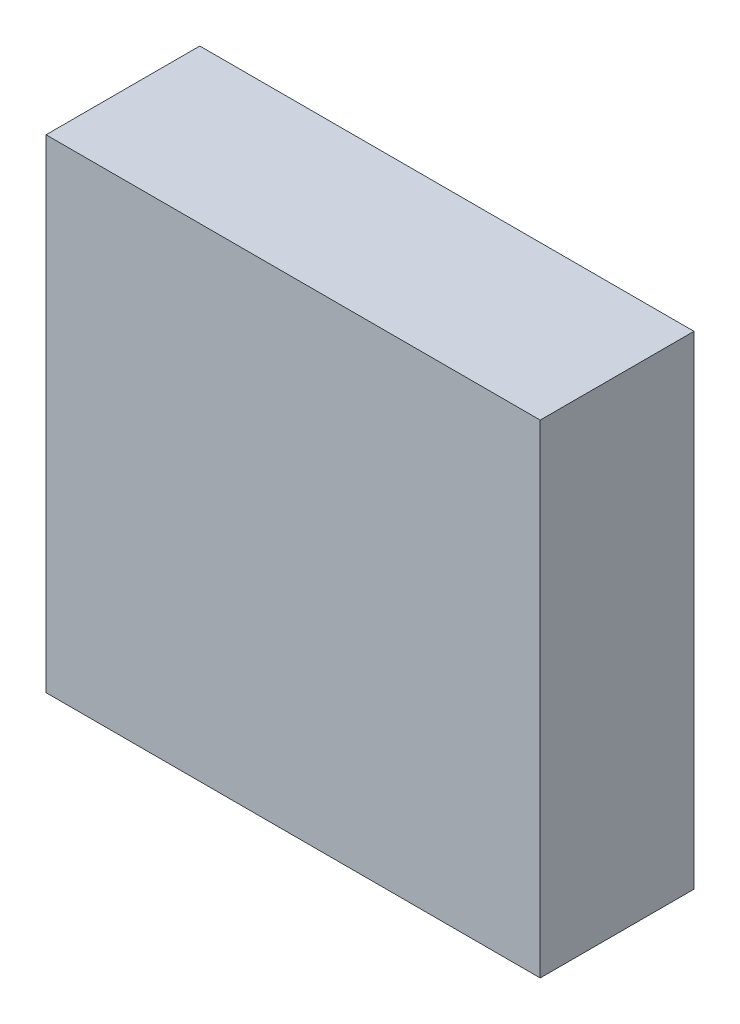
ISO-10303-21;
HEADER;
FILE_DESCRIPTION(('STEP AP214'),'2;1');
FILE_NAME('part.step','',(''),(''),'','','');
FILE_SCHEMA(('AUTOMOTIVE_DESIGN { 1 0 10303 214 1 1 1 1 }'));
ENDSEC;
DATA;
#1=APPLICATION_CONTEXT('core data for automotive mechanical design processes');
#2=APPLICATION_PROTOCOL_DEFINITION('international standard','automotive_design',2000,#1);
#3=PRODUCT_CONTEXT('',#1,'mechanical');
#4=PRODUCT('Part','Part','',(#3));
#5=PRODUCT_RELATED_PRODUCT_CATEGORY('part','',(#4));
#6=PRODUCT_DEFINITION_FORMATION('','',#4);
#7=PRODUCT_DEFINITION_CONTEXT('part definition',#1,'design');
#8=PRODUCT_DEFINITION('design','',#6,#7);
#9=PRODUCT_DEFINITION_SHAPE('','',#8);
#10=(LENGTH_UNIT() NAMED_UNIT(*) SI_UNIT(.MILLI.,.METRE.));
#11=(NAMED_UNIT(*) PLANE_ANGLE_UNIT() SI_UNIT($,.RADIAN.));
#12=(NAMED_UNIT(*) SI_UNIT($,.STERADIAN.) SOLID_ANGLE_UNIT());
#13=UNCERTAINTY_MEASURE_WITH_UNIT(LENGTH_MEASURE(1.E-05),#10,'distance_accuracy_value','');
#14=(GEOMETRIC_REPRESENTATION_CONTEXT(3) GLOBAL_UNCERTAINTY_ASSIGNED_CONTEXT((#13)) GLOBAL_UNIT_ASSIGNED_CONTEXT((#10,
#11,#12)) REPRESENTATION_CONTEXT('',''));
#15=CARTESIAN_POINT('',(0.,0.,0.));
#16=DIRECTION('',(0.,0.,1.));
#17=DIRECTION('',(1.,0.,0.));
#18=AXIS2_PLACEMENT_3D('',#15,#16,#17);
#19=CARTESIAN_POINT('',(-57.15,55.88,17.78));
#20=DIRECTION('',(1.,0.,0.));
#21=DIRECTION('',(0.,0.,-1.));
#22=AXIS2_PLACEMENT_3D('',#19,#20,#21);
#23=PLANE('',#22);
#24=DIRECTION('',(0.,-1.,0.));
#25=VECTOR('',#24,1.);
#26=CARTESIAN_POINT('',(-57.15,55.88,-17.78));
#27=LINE('',#26,#25);
#28=CARTESIAN_POINT('',(-57.15,55.88,-17.78));
#29=VERTEX_POINT('',#28);
#30=CARTESIAN_POINT('',(-57.15,-55.88,-17.78));
#31=VERTEX_POINT('',#30);
#32=EDGE_CURVE('E100',#29,#31,#27,.T.);
#33=ORIENTED_EDGE('',*,*,#32,.T.);
#34=DIRECTION('',(0.,0.,-1.));
#35=VECTOR('',#34,1.);
#36=CARTESIAN_POINT('',(-57.15,-55.88,17.78));
#37=LINE('',#36,#35);
#38=CARTESIAN_POINT('',(-57.15,-55.88,17.78));
#39=VERTEX_POINT('',#38);
#40=EDGE_CURVE('E11',#39,#31,#37,.T.);
#41=ORIENTED_EDGE('',*,*,#40,.F.);
#42=DIRECTION('',(0.,-1.,0.));
#43=VECTOR('',#42,1.);
#44=CARTESIAN_POINT('',(-57.15,55.88,17.78));
#45=LINE('',#44,#43);
#46=CARTESIAN_POINT('',(-57.15,55.88,17.78));
#47=VERTEX_POINT('',#46);
#48=EDGE_CURVE('E88',#47,#39,#45,.T.);
#49=ORIENTED_EDGE('',*,*,#48,.F.);
#50=DIRECTION('',(0.,0.,-1.));
#51=VECTOR('',#50,1.);
#52=CARTESIAN_POINT('',(-57.15,55.88,17.78));
#53=LINE('',#52,#51);
#54=EDGE_CURVE('E96',#47,#29,#53,.T.);
#55=ORIENTED_EDGE('',*,*,#54,.T.);
#56=EDGE_LOOP('',(#33,#41,#49,#55));
#57=FACE_BOUND('',#56,.T.);
#58=ADVANCED_FACE('F37',(#57),#23,.F.);
#59=CARTESIAN_POINT('',(-57.15,-55.88,17.78));
#60=DIRECTION('',(0.,1.,0.));
#61=DIRECTION('',(0.,0.,1.));
#62=AXIS2_PLACEMENT_3D('',#59,#60,#61);
#63=PLANE('',#62);
#64=DIRECTION('',(1.,0.,0.));
#65=VECTOR('',#64,1.);
#66=CARTESIAN_POINT('',(-57.15,-55.88,-17.78));
#67=LINE('',#66,#65);
#68=CARTESIAN_POINT('',(57.15,-55.88,-17.78));
#69=VERTEX_POINT('',#68);
#70=EDGE_CURVE('E92',#31,#69,#67,.T.);
#71=ORIENTED_EDGE('',*,*,#70,.T.);
#72=DIRECTION('',(0.,0.,-1.));
#73=VECTOR('',#72,1.);
#74=CARTESIAN_POINT('',(57.15,-55.88,17.78));
#75=LINE('',#74,#73);
#76=CARTESIAN_POINT('',(57.15,-55.88,17.78));
#77=VERTEX_POINT('',#76);
#78=EDGE_CURVE('E45',#77,#69,#75,.T.);
#79=ORIENTED_EDGE('',*,*,#78,.F.);
#80=DIRECTION('',(1.,0.,0.));
#81=VECTOR('',#80,1.);
#82=CARTESIAN_POINT('',(-57.15,-55.88,17.78));
#83=LINE('',#82,#81);
#84=EDGE_CURVE('E83',#39,#77,#83,.T.);
#85=ORIENTED_EDGE('',*,*,#84,.F.);
#86=ORIENTED_EDGE('',*,*,#40,.T.);
#87=EDGE_LOOP('',(#71,#79,#85,#86));
#88=FACE_BOUND('',#87,.T.);
#89=ADVANCED_FACE('F91',(#88),#63,.F.);
#90=CARTESIAN_POINT('',(57.15,55.88,17.78));
#91=DIRECTION('',(-1.,0.,0.));
#92=DIRECTION('',(0.,0.,1.));
#93=AXIS2_PLACEMENT_3D('',#90,#91,#92);
#94=PLANE('',#93);
#95=DIRECTION('',(0.,1.,0.));
#96=VECTOR('',#95,1.);
#97=CARTESIAN_POINT('',(57.15,55.88,-17.78));
#98=LINE('',#97,#96);
#99=CARTESIAN_POINT('',(57.15,55.88,-17.78));
#100=VERTEX_POINT('',#99);
#101=EDGE_CURVE('E70',#69,#100,#98,.T.);
#102=ORIENTED_EDGE('',*,*,#101,.T.);
#103=DIRECTION('',(0.,0.,-1.));
#104=VECTOR('',#103,1.);
#105=CARTESIAN_POINT('',(57.15,55.88,17.78));
#106=LINE('',#105,#104);
#107=CARTESIAN_POINT('',(57.15,55.88,17.78));
#108=VERTEX_POINT('',#107);
#109=EDGE_CURVE('E93',#108,#100,#106,.T.);
#110=ORIENTED_EDGE('',*,*,#109,.F.);
#111=DIRECTION('',(0.,1.,0.));
#112=VECTOR('',#111,1.);
#113=CARTESIAN_POINT('',(57.15,55.88,17.78));
#114=LINE('',#113,#112);
#115=EDGE_CURVE('E86',#77,#108,#114,.T.);
#116=ORIENTED_EDGE('',*,*,#115,.F.);
#117=ORIENTED_EDGE('',*,*,#78,.T.);
#118=EDGE_LOOP('',(#102,#110,#116,#117));
#119=FACE_BOUND('',#118,.T.);
#120=ADVANCED_FACE('F94',(#119),#94,.F.);
#121=CARTESIAN_POINT('',(-57.15,55.88,17.78));
#122=DIRECTION('',(0.,-1.,0.));
#123=DIRECTION('',(0.,0.,-1.));
#124=AXIS2_PLACEMENT_3D('',#121,#122,#123);
#125=PLANE('',#124);
#126=DIRECTION('',(-1.,0.,0.));
#127=VECTOR('',#126,1.);
#128=CARTESIAN_POINT('',(-57.15,55.88,-17.78));
#129=LINE('',#128,#127);
#130=EDGE_CURVE('E76',#100,#29,#129,.T.);
#131=ORIENTED_EDGE('',*,*,#130,.T.);
#132=ORIENTED_EDGE('',*,*,#54,.F.);
#133=DIRECTION('',(-1.,0.,0.));
#134=VECTOR('',#133,1.);
#135=CARTESIAN_POINT('',(-57.15,55.88,17.78));
#136=LINE('',#135,#134);
#137=EDGE_CURVE('E53',#108,#47,#136,.T.);
#138=ORIENTED_EDGE('',*,*,#137,.F.);
#139=ORIENTED_EDGE('',*,*,#109,.T.);
#140=EDGE_LOOP('',(#131,#132,#138,#139));
#141=FACE_BOUND('',#140,.T.);
#142=ADVANCED_FACE('F107',(#141),#125,.F.);
#143=CARTESIAN_POINT('',(0.,0.,17.78));
#144=DIRECTION('',(0.,0.,1.));
#145=DIRECTION('',(1.,0.,0.));
#146=AXIS2_PLACEMENT_3D('',#143,#144,#145);
#147=PLANE('',#146);
#148=ORIENTED_EDGE('',*,*,#48,.T.);
#149=ORIENTED_EDGE('',*,*,#84,.T.);
#150=ORIENTED_EDGE('',*,*,#115,.T.);
#151=ORIENTED_EDGE('',*,*,#137,.T.);
#152=EDGE_LOOP('',(#148,#149,#150,#151));
#153=FACE_BOUND('',#152,.T.);
#154=ADVANCED_FACE('F84',(#153),#147,.T.);
#155=CARTESIAN_POINT('',(0.,0.,-17.78));
#156=DIRECTION('',(0.,0.,1.));
#157=DIRECTION('',(1.,0.,0.));
#158=AXIS2_PLACEMENT_3D('',#155,#156,#157);
#159=PLANE('',#158);
#160=ORIENTED_EDGE('',*,*,#32,.F.);
#161=ORIENTED_EDGE('',*,*,#130,.F.);
#162=ORIENTED_EDGE('',*,*,#101,.F.);
#163=ORIENTED_EDGE('',*,*,#70,.F.);
#164=EDGE_LOOP('',(#160,#161,#162,#163));
#165=FACE_BOUND('',#164,.T.);
#166=ADVANCED_FACE('F110',(#165),#159,.F.);
#167=CLOSED_SHELL('',(#58,#89,#120,#142,#154,#166));
#168=MANIFOLD_SOLID_BREP('B2',#167);
#169=ADVANCED_BREP_SHAPE_REPRESENTATION('',(#18,#168),#14);
#170=SHAPE_DEFINITION_REPRESENTATION(#9,#169);
ENDSEC;
END-ISO-10303-21;
